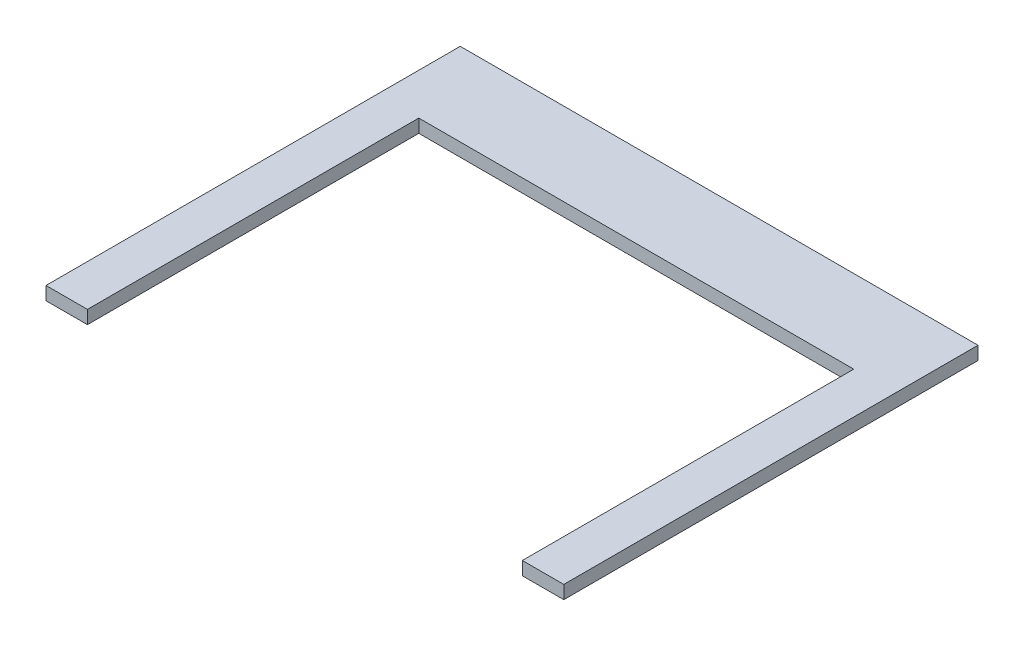
ISO-10303-21;
HEADER;
FILE_DESCRIPTION(('STEP AP214'),'2;1');
FILE_NAME('part.step','',(''),(''),'','','');
FILE_SCHEMA(('AUTOMOTIVE_DESIGN { 1 0 10303 214 1 1 1 1 }'));
ENDSEC;
DATA;
#1=APPLICATION_CONTEXT('core data for automotive mechanical design processes');
#2=APPLICATION_PROTOCOL_DEFINITION('international standard','automotive_design',2000,#1);
#3=PRODUCT_CONTEXT('',#1,'mechanical');
#4=PRODUCT('Part','Part','',(#3));
#5=PRODUCT_RELATED_PRODUCT_CATEGORY('part','',(#4));
#6=PRODUCT_DEFINITION_FORMATION('','',#4);
#7=PRODUCT_DEFINITION_CONTEXT('part definition',#1,'design');
#8=PRODUCT_DEFINITION('design','',#6,#7);
#9=PRODUCT_DEFINITION_SHAPE('','',#8);
#10=(LENGTH_UNIT() NAMED_UNIT(*) SI_UNIT(.MILLI.,.METRE.));
#11=(NAMED_UNIT(*) PLANE_ANGLE_UNIT() SI_UNIT($,.RADIAN.));
#12=(NAMED_UNIT(*) SI_UNIT($,.STERADIAN.) SOLID_ANGLE_UNIT());
#13=UNCERTAINTY_MEASURE_WITH_UNIT(LENGTH_MEASURE(1.E-05),#10,'distance_accuracy_value','');
#14=(GEOMETRIC_REPRESENTATION_CONTEXT(3) GLOBAL_UNCERTAINTY_ASSIGNED_CONTEXT((#13)) GLOBAL_UNIT_ASSIGNED_CONTEXT((#10,
#11,#12)) REPRESENTATION_CONTEXT('',''));
#15=CARTESIAN_POINT('',(0.,0.,0.));
#16=DIRECTION('',(0.,0.,1.));
#17=DIRECTION('',(1.,0.,0.));
#18=AXIS2_PLACEMENT_3D('',#15,#16,#17);
#19=CARTESIAN_POINT('',(-79.375,4.064,-127.));
#20=DIRECTION('',(1.,0.,0.));
#21=DIRECTION('',(0.,0.,-1.));
#22=AXIS2_PLACEMENT_3D('',#19,#20,#21);
#23=PLANE('',#22);
#24=DIRECTION('',(0.,0.,1.));
#25=VECTOR('',#24,1.);
#26=CARTESIAN_POINT('',(-79.375,0.,-127.));
#27=LINE('',#26,#25);
#28=CARTESIAN_POINT('',(-79.375,0.,-127.));
#29=VERTEX_POINT('',#28);
#30=CARTESIAN_POINT('',(-79.375,0.,0.));
#31=VERTEX_POINT('',#30);
#32=EDGE_CURVE('E129',#29,#31,#27,.T.);
#33=ORIENTED_EDGE('',*,*,#32,.T.);
#34=DIRECTION('',(0.,-1.,0.));
#35=VECTOR('',#34,1.);
#36=CARTESIAN_POINT('',(-79.375,4.064,0.));
#37=LINE('',#36,#35);
#38=CARTESIAN_POINT('',(-79.375,4.064,0.));
#39=VERTEX_POINT('',#38);
#40=EDGE_CURVE('E11',#39,#31,#37,.T.);
#41=ORIENTED_EDGE('',*,*,#40,.F.);
#42=DIRECTION('',(0.,0.,1.));
#43=VECTOR('',#42,1.);
#44=CARTESIAN_POINT('',(-79.375,4.064,-127.));
#45=LINE('',#44,#43);
#46=CARTESIAN_POINT('',(-79.375,4.064,-127.));
#47=VERTEX_POINT('',#46);
#48=EDGE_CURVE('E143',#47,#39,#45,.T.);
#49=ORIENTED_EDGE('',*,*,#48,.F.);
#50=DIRECTION('',(0.,-1.,0.));
#51=VECTOR('',#50,1.);
#52=CARTESIAN_POINT('',(-79.375,4.064,-127.));
#53=LINE('',#52,#51);
#54=EDGE_CURVE('E125',#47,#29,#53,.T.);
#55=ORIENTED_EDGE('',*,*,#54,.T.);
#56=EDGE_LOOP('',(#33,#41,#49,#55));
#57=FACE_BOUND('',#56,.T.);
#58=ADVANCED_FACE('F33',(#57),#23,.F.);
#59=CARTESIAN_POINT('',(-79.375,4.064,0.));
#60=DIRECTION('',(0.,0.,-1.));
#61=DIRECTION('',(-1.,0.,0.));
#62=AXIS2_PLACEMENT_3D('',#59,#60,#61);
#63=PLANE('',#62);
#64=DIRECTION('',(1.,0.,0.));
#65=VECTOR('',#64,1.);
#66=CARTESIAN_POINT('',(-79.375,0.,0.));
#67=LINE('',#66,#65);
#68=CARTESIAN_POINT('',(-66.675,0.,0.));
#69=VERTEX_POINT('',#68);
#70=EDGE_CURVE('E132',#31,#69,#67,.T.);
#71=ORIENTED_EDGE('',*,*,#70,.T.);
#72=DIRECTION('',(0.,-1.,0.));
#73=VECTOR('',#72,1.);
#74=CARTESIAN_POINT('',(-66.675,4.064,0.));
#75=LINE('',#74,#73);
#76=CARTESIAN_POINT('',(-66.675,4.064,0.));
#77=VERTEX_POINT('',#76);
#78=EDGE_CURVE('E41',#77,#69,#75,.T.);
#79=ORIENTED_EDGE('',*,*,#78,.F.);
#80=DIRECTION('',(1.,0.,0.));
#81=VECTOR('',#80,1.);
#82=CARTESIAN_POINT('',(-79.375,4.064,0.));
#83=LINE('',#82,#81);
#84=EDGE_CURVE('E92',#39,#77,#83,.T.);
#85=ORIENTED_EDGE('',*,*,#84,.F.);
#86=ORIENTED_EDGE('',*,*,#40,.T.);
#87=EDGE_LOOP('',(#71,#79,#85,#86));
#88=FACE_BOUND('',#87,.T.);
#89=ADVANCED_FACE('F178',(#88),#63,.F.);
#90=CARTESIAN_POINT('',(-66.675,4.064,0.));
#91=DIRECTION('',(-1.,0.,0.));
#92=DIRECTION('',(0.,0.,1.));
#93=AXIS2_PLACEMENT_3D('',#90,#91,#92);
#94=PLANE('',#93);
#95=DIRECTION('',(0.,0.,-1.));
#96=VECTOR('',#95,1.);
#97=CARTESIAN_POINT('',(-66.675,0.,0.));
#98=LINE('',#97,#96);
#99=CARTESIAN_POINT('',(-66.675,0.,-101.6));
#100=VERTEX_POINT('',#99);
#101=EDGE_CURVE('E134',#69,#100,#98,.T.);
#102=ORIENTED_EDGE('',*,*,#101,.T.);
#103=DIRECTION('',(0.,-1.,0.));
#104=VECTOR('',#103,1.);
#105=CARTESIAN_POINT('',(-66.675,4.064,-101.6));
#106=LINE('',#105,#104);
#107=CARTESIAN_POINT('',(-66.675,4.064,-101.6));
#108=VERTEX_POINT('',#107);
#109=EDGE_CURVE('E150',#108,#100,#106,.T.);
#110=ORIENTED_EDGE('',*,*,#109,.F.);
#111=DIRECTION('',(0.,0.,-1.));
#112=VECTOR('',#111,1.);
#113=CARTESIAN_POINT('',(-66.675,4.064,0.));
#114=LINE('',#113,#112);
#115=EDGE_CURVE('E158',#77,#108,#114,.T.);
#116=ORIENTED_EDGE('',*,*,#115,.F.);
#117=ORIENTED_EDGE('',*,*,#78,.T.);
#118=EDGE_LOOP('',(#102,#110,#116,#117));
#119=FACE_BOUND('',#118,.T.);
#120=ADVANCED_FACE('F156',(#119),#94,.F.);
#121=CARTESIAN_POINT('',(-66.675,4.064,-101.6));
#122=DIRECTION('',(0.,0.,-1.));
#123=DIRECTION('',(-1.,0.,0.));
#124=AXIS2_PLACEMENT_3D('',#121,#122,#123);
#125=PLANE('',#124);
#126=DIRECTION('',(1.,0.,0.));
#127=VECTOR('',#126,1.);
#128=CARTESIAN_POINT('',(-66.675,0.,-101.6));
#129=LINE('',#128,#127);
#130=CARTESIAN_POINT('',(66.675,0.,-101.6));
#131=VERTEX_POINT('',#130);
#132=EDGE_CURVE('E136',#100,#131,#129,.T.);
#133=ORIENTED_EDGE('',*,*,#132,.T.);
#134=DIRECTION('',(0.,-1.,0.));
#135=VECTOR('',#134,1.);
#136=CARTESIAN_POINT('',(66.675,4.064,-101.6));
#137=LINE('',#136,#135);
#138=CARTESIAN_POINT('',(66.675,4.064,-101.6));
#139=VERTEX_POINT('',#138);
#140=EDGE_CURVE('E147',#139,#131,#137,.T.);
#141=ORIENTED_EDGE('',*,*,#140,.F.);
#142=DIRECTION('',(1.,0.,0.));
#143=VECTOR('',#142,1.);
#144=CARTESIAN_POINT('',(-66.675,4.064,-101.6));
#145=LINE('',#144,#143);
#146=EDGE_CURVE('E170',#108,#139,#145,.T.);
#147=ORIENTED_EDGE('',*,*,#146,.F.);
#148=ORIENTED_EDGE('',*,*,#109,.T.);
#149=EDGE_LOOP('',(#133,#141,#147,#148));
#150=FACE_BOUND('',#149,.T.);
#151=ADVANCED_FACE('F166',(#150),#125,.F.);
#152=CARTESIAN_POINT('',(66.675,4.064,-101.6));
#153=DIRECTION('',(1.,0.,0.));
#154=DIRECTION('',(0.,0.,-1.));
#155=AXIS2_PLACEMENT_3D('',#152,#153,#154);
#156=PLANE('',#155);
#157=DIRECTION('',(0.,0.,1.));
#158=VECTOR('',#157,1.);
#159=CARTESIAN_POINT('',(66.675,0.,-101.6));
#160=LINE('',#159,#158);
#161=CARTESIAN_POINT('',(66.675,0.,0.));
#162=VERTEX_POINT('',#161);
#163=EDGE_CURVE('E138',#131,#162,#160,.T.);
#164=ORIENTED_EDGE('',*,*,#163,.T.);
#165=DIRECTION('',(0.,-1.,0.));
#166=VECTOR('',#165,1.);
#167=CARTESIAN_POINT('',(66.675,4.064,0.));
#168=LINE('',#167,#166);
#169=CARTESIAN_POINT('',(66.675,4.064,0.));
#170=VERTEX_POINT('',#169);
#171=EDGE_CURVE('E120',#170,#162,#168,.T.);
#172=ORIENTED_EDGE('',*,*,#171,.F.);
#173=DIRECTION('',(0.,0.,1.));
#174=VECTOR('',#173,1.);
#175=CARTESIAN_POINT('',(66.675,4.064,-101.6));
#176=LINE('',#175,#174);
#177=EDGE_CURVE('E111',#139,#170,#176,.T.);
#178=ORIENTED_EDGE('',*,*,#177,.F.);
#179=ORIENTED_EDGE('',*,*,#140,.T.);
#180=EDGE_LOOP('',(#164,#172,#178,#179));
#181=FACE_BOUND('',#180,.T.);
#182=ADVANCED_FACE('F169',(#181),#156,.F.);
#183=CARTESIAN_POINT('',(66.675,4.064,0.));
#184=DIRECTION('',(0.,0.,-1.));
#185=DIRECTION('',(-1.,0.,0.));
#186=AXIS2_PLACEMENT_3D('',#183,#184,#185);
#187=PLANE('',#186);
#188=DIRECTION('',(1.,0.,0.));
#189=VECTOR('',#188,1.);
#190=CARTESIAN_POINT('',(66.675,0.,0.));
#191=LINE('',#190,#189);
#192=CARTESIAN_POINT('',(79.375,0.,0.));
#193=VERTEX_POINT('',#192);
#194=EDGE_CURVE('E119',#162,#193,#191,.T.);
#195=ORIENTED_EDGE('',*,*,#194,.T.);
#196=DIRECTION('',(0.,-1.,0.));
#197=VECTOR('',#196,1.);
#198=CARTESIAN_POINT('',(79.375,4.064,0.));
#199=LINE('',#198,#197);
#200=CARTESIAN_POINT('',(79.375,4.064,0.));
#201=VERTEX_POINT('',#200);
#202=EDGE_CURVE('E116',#201,#193,#199,.T.);
#203=ORIENTED_EDGE('',*,*,#202,.F.);
#204=DIRECTION('',(1.,0.,0.));
#205=VECTOR('',#204,1.);
#206=CARTESIAN_POINT('',(66.675,4.064,0.));
#207=LINE('',#206,#205);
#208=EDGE_CURVE('E105',#170,#201,#207,.T.);
#209=ORIENTED_EDGE('',*,*,#208,.F.);
#210=ORIENTED_EDGE('',*,*,#171,.T.);
#211=EDGE_LOOP('',(#195,#203,#209,#210));
#212=FACE_BOUND('',#211,.T.);
#213=ADVANCED_FACE('F117',(#212),#187,.F.);
#214=CARTESIAN_POINT('',(79.375,4.064,0.));
#215=DIRECTION('',(-1.,0.,0.));
#216=DIRECTION('',(0.,0.,1.));
#217=AXIS2_PLACEMENT_3D('',#214,#215,#216);
#218=PLANE('',#217);
#219=DIRECTION('',(0.,0.,-1.));
#220=VECTOR('',#219,1.);
#221=CARTESIAN_POINT('',(79.375,0.,0.));
#222=LINE('',#221,#220);
#223=CARTESIAN_POINT('',(79.3749999999999,0.,-127.));
#224=VERTEX_POINT('',#223);
#225=EDGE_CURVE('E78',#193,#224,#222,.T.);
#226=ORIENTED_EDGE('',*,*,#225,.T.);
#227=DIRECTION('',(0.,-1.,0.));
#228=VECTOR('',#227,1.);
#229=CARTESIAN_POINT('',(79.3749999999999,4.064,-127.));
#230=LINE('',#229,#228);
#231=CARTESIAN_POINT('',(79.3749999999999,4.064,-127.));
#232=VERTEX_POINT('',#231);
#233=EDGE_CURVE('E121',#232,#224,#230,.T.);
#234=ORIENTED_EDGE('',*,*,#233,.F.);
#235=DIRECTION('',(0.,0.,-1.));
#236=VECTOR('',#235,1.);
#237=CARTESIAN_POINT('',(79.375,4.064,0.));
#238=LINE('',#237,#236);
#239=EDGE_CURVE('E109',#201,#232,#238,.T.);
#240=ORIENTED_EDGE('',*,*,#239,.F.);
#241=ORIENTED_EDGE('',*,*,#202,.T.);
#242=EDGE_LOOP('',(#226,#234,#240,#241));
#243=FACE_BOUND('',#242,.T.);
#244=ADVANCED_FACE('F123',(#243),#218,.F.);
#245=CARTESIAN_POINT('',(79.3749999999999,4.064,-127.));
#246=DIRECTION('',(0.,0.,1.));
#247=DIRECTION('',(1.,0.,0.));
#248=AXIS2_PLACEMENT_3D('',#245,#246,#247);
#249=PLANE('',#248);
#250=DIRECTION('',(-1.,0.,0.));
#251=VECTOR('',#250,1.);
#252=CARTESIAN_POINT('',(79.3749999999999,0.,-127.));
#253=LINE('',#252,#251);
#254=EDGE_CURVE('E84',#224,#29,#253,.T.);
#255=ORIENTED_EDGE('',*,*,#254,.T.);
#256=ORIENTED_EDGE('',*,*,#54,.F.);
#257=DIRECTION('',(-1.,0.,0.));
#258=VECTOR('',#257,1.);
#259=CARTESIAN_POINT('',(79.3749999999999,4.064,-127.));
#260=LINE('',#259,#258);
#261=EDGE_CURVE('E49',#232,#47,#260,.T.);
#262=ORIENTED_EDGE('',*,*,#261,.F.);
#263=ORIENTED_EDGE('',*,*,#233,.T.);
#264=EDGE_LOOP('',(#255,#256,#262,#263));
#265=FACE_BOUND('',#264,.T.);
#266=ADVANCED_FACE('F194',(#265),#249,.F.);
#267=CARTESIAN_POINT('',(0.,4.064,0.));
#268=DIRECTION('',(0.,1.,0.));
#269=DIRECTION('',(0.,0.,1.));
#270=AXIS2_PLACEMENT_3D('',#267,#268,#269);
#271=PLANE('',#270);
#272=ORIENTED_EDGE('',*,*,#48,.T.);
#273=ORIENTED_EDGE('',*,*,#84,.T.);
#274=ORIENTED_EDGE('',*,*,#115,.T.);
#275=ORIENTED_EDGE('',*,*,#146,.T.);
#276=ORIENTED_EDGE('',*,*,#177,.T.);
#277=ORIENTED_EDGE('',*,*,#208,.T.);
#278=ORIENTED_EDGE('',*,*,#239,.T.);
#279=ORIENTED_EDGE('',*,*,#261,.T.);
#280=EDGE_LOOP('',(#272,#273,#274,#275,#276,#277,#278,#279));
#281=FACE_BOUND('',#280,.T.);
#282=ADVANCED_FACE('F107',(#281),#271,.T.);
#283=CARTESIAN_POINT('',(0.,0.,0.));
#284=DIRECTION('',(0.,1.,0.));
#285=DIRECTION('',(0.,0.,1.));
#286=AXIS2_PLACEMENT_3D('',#283,#284,#285);
#287=PLANE('',#286);
#288=ORIENTED_EDGE('',*,*,#32,.F.);
#289=ORIENTED_EDGE('',*,*,#254,.F.);
#290=ORIENTED_EDGE('',*,*,#225,.F.);
#291=ORIENTED_EDGE('',*,*,#194,.F.);
#292=ORIENTED_EDGE('',*,*,#163,.F.);
#293=ORIENTED_EDGE('',*,*,#132,.F.);
#294=ORIENTED_EDGE('',*,*,#101,.F.);
#295=ORIENTED_EDGE('',*,*,#70,.F.);
#296=EDGE_LOOP('',(#288,#289,#290,#291,#292,#293,#294,#295));
#297=FACE_BOUND('',#296,.T.);
#298=ADVANCED_FACE('F162',(#297),#287,.F.);
#299=CLOSED_SHELL('',(#58,#89,#120,#151,#182,#213,#244,#266,#282,#298));
#300=MANIFOLD_SOLID_BREP('B2',#299);
#301=ADVANCED_BREP_SHAPE_REPRESENTATION('',(#18,#300),#14);
#302=SHAPE_DEFINITION_REPRESENTATION(#9,#301);
ENDSEC;
END-ISO-10303-21;
